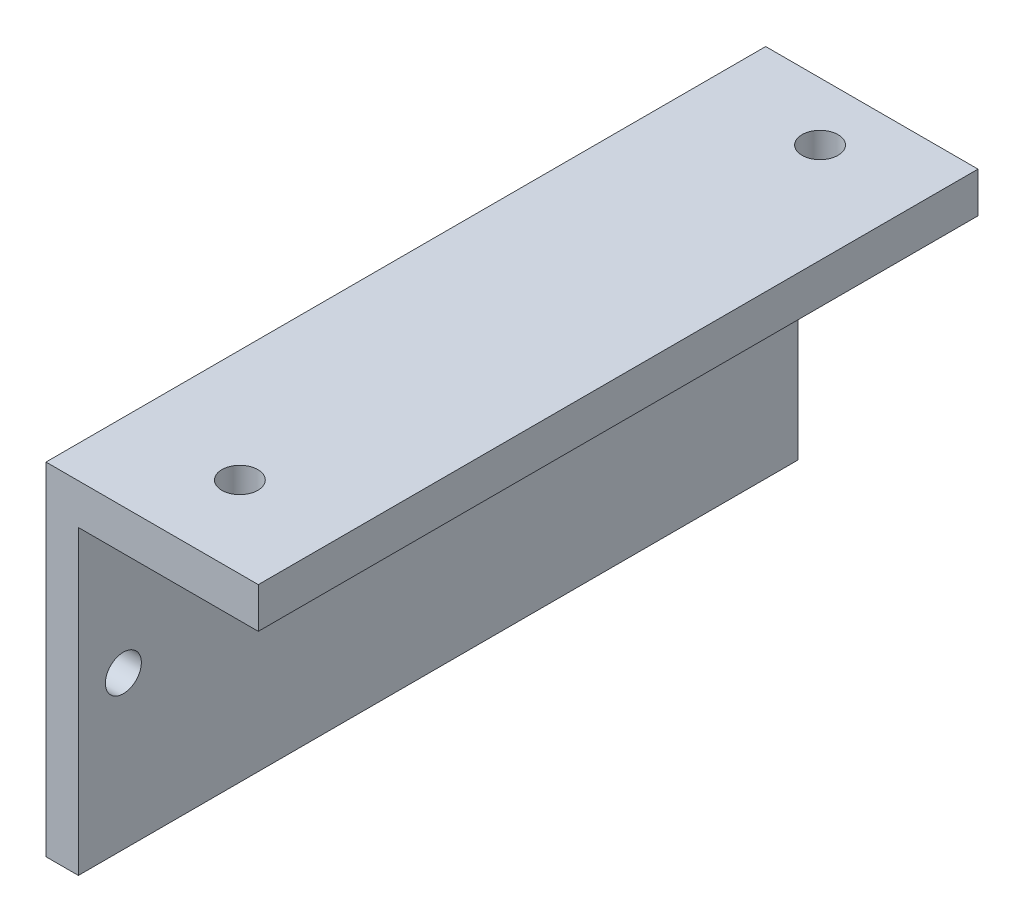
ISO-10303-21;
HEADER;
FILE_DESCRIPTION(('STEP AP214'),'2;1');
FILE_NAME('part.step','',(''),(''),'','','');
FILE_SCHEMA(('AUTOMOTIVE_DESIGN { 1 0 10303 214 1 1 1 1 }'));
ENDSEC;
DATA;
#1=APPLICATION_CONTEXT('core data for automotive mechanical design processes');
#2=APPLICATION_PROTOCOL_DEFINITION('international standard','automotive_design',2000,#1);
#3=PRODUCT_CONTEXT('',#1,'mechanical');
#4=PRODUCT('Part','Part','',(#3));
#5=PRODUCT_RELATED_PRODUCT_CATEGORY('part','',(#4));
#6=PRODUCT_DEFINITION_FORMATION('','',#4);
#7=PRODUCT_DEFINITION_CONTEXT('part definition',#1,'design');
#8=PRODUCT_DEFINITION('design','',#6,#7);
#9=PRODUCT_DEFINITION_SHAPE('','',#8);
#10=(LENGTH_UNIT() NAMED_UNIT(*) SI_UNIT(.MILLI.,.METRE.));
#11=(NAMED_UNIT(*) PLANE_ANGLE_UNIT() SI_UNIT($,.RADIAN.));
#12=(NAMED_UNIT(*) SI_UNIT($,.STERADIAN.) SOLID_ANGLE_UNIT());
#13=UNCERTAINTY_MEASURE_WITH_UNIT(LENGTH_MEASURE(1.E-05),#10,'distance_accuracy_value','');
#14=(GEOMETRIC_REPRESENTATION_CONTEXT(3) GLOBAL_UNCERTAINTY_ASSIGNED_CONTEXT((#13)) GLOBAL_UNIT_ASSIGNED_CONTEXT((#10,
#11,#12)) REPRESENTATION_CONTEXT('',''));
#15=CARTESIAN_POINT('',(0.,0.,0.));
#16=DIRECTION('',(0.,0.,1.));
#17=DIRECTION('',(1.,0.,0.));
#18=AXIS2_PLACEMENT_3D('',#15,#16,#17);
#19=CARTESIAN_POINT('',(23.6,0.,40.));
#20=DIRECTION('',(0.,0.,-1.));
#21=DIRECTION('',(-1.,0.,0.));
#22=AXIS2_PLACEMENT_3D('',#19,#20,#21);
#23=PLANE('',#22);
#24=DIRECTION('',(0.,-1.,0.));
#25=VECTOR('',#24,1.);
#26=CARTESIAN_POINT('',(0.,0.,40.));
#27=LINE('',#26,#25);
#28=CARTESIAN_POINT('',(0.,19.,40.));
#29=VERTEX_POINT('',#28);
#30=CARTESIAN_POINT('',(0.,-19.,40.));
#31=VERTEX_POINT('',#30);
#32=EDGE_CURVE('E192',#29,#31,#27,.T.);
#33=ORIENTED_EDGE('',*,*,#32,.T.);
#34=DIRECTION('',(-1.,0.,0.));
#35=VECTOR('',#34,1.);
#36=CARTESIAN_POINT('',(3.6,-19.,40.));
#37=LINE('',#36,#35);
#38=CARTESIAN_POINT('',(3.6,-19.,40.));
#39=VERTEX_POINT('',#38);
#40=EDGE_CURVE('E99',#39,#31,#37,.T.);
#41=ORIENTED_EDGE('',*,*,#40,.F.);
#42=DIRECTION('',(0.,-1.,0.));
#43=VECTOR('',#42,1.);
#44=CARTESIAN_POINT('',(3.6,0.,40.));
#45=LINE('',#44,#43);
#46=CARTESIAN_POINT('',(3.6,14.5,40.));
#47=VERTEX_POINT('',#46);
#48=EDGE_CURVE('E97',#47,#39,#45,.T.);
#49=ORIENTED_EDGE('',*,*,#48,.F.);
#50=DIRECTION('',(-1.,0.,0.));
#51=VECTOR('',#50,1.);
#52=CARTESIAN_POINT('',(23.6,14.5,40.));
#53=LINE('',#52,#51);
#54=CARTESIAN_POINT('',(23.6,14.5,40.));
#55=VERTEX_POINT('',#54);
#56=EDGE_CURVE('E11',#55,#47,#53,.T.);
#57=ORIENTED_EDGE('',*,*,#56,.F.);
#58=DIRECTION('',(0.,-1.,0.));
#59=VECTOR('',#58,1.);
#60=CARTESIAN_POINT('',(23.6,0.,40.));
#61=LINE('',#60,#59);
#62=CARTESIAN_POINT('',(23.6,19.,40.));
#63=VERTEX_POINT('',#62);
#64=EDGE_CURVE('E193',#63,#55,#61,.T.);
#65=ORIENTED_EDGE('',*,*,#64,.F.);
#66=DIRECTION('',(-1.,0.,0.));
#67=VECTOR('',#66,1.);
#68=CARTESIAN_POINT('',(23.6,19.,40.));
#69=LINE('',#68,#67);
#70=EDGE_CURVE('E60',#63,#29,#69,.T.);
#71=ORIENTED_EDGE('',*,*,#70,.T.);
#72=EDGE_LOOP('',(#33,#41,#49,#57,#65,#71));
#73=FACE_BOUND('',#72,.T.);
#74=ADVANCED_FACE('F37',(#73),#23,.F.);
#75=CARTESIAN_POINT('',(23.6,14.5,0.));
#76=DIRECTION('',(0.,1.,0.));
#77=DIRECTION('',(0.,0.,1.));
#78=AXIS2_PLACEMENT_3D('',#75,#76,#77);
#79=PLANE('',#78);
#80=CARTESIAN_POINT('',(12.5,14.5,30.9508755551064));
#81=DIRECTION('',(0.,1.,0.));
#82=DIRECTION('',(0.,0.,1.));
#83=AXIS2_PLACEMENT_3D('',#80,#81,#82);
#84=CIRCLE('',#83,2.);
#85=CARTESIAN_POINT('',(12.5,14.5,32.9508755551064));
#86=VERTEX_POINT('',#85);
#87=EDGE_CURVE('E162',#86,#86,#84,.F.);
#88=ORIENTED_EDGE('',*,*,#87,.F.);
#89=EDGE_LOOP('',(#88));
#90=FACE_BOUND('',#89,.T.);
#91=CARTESIAN_POINT('',(12.5,14.5,-33.5413181600046));
#92=DIRECTION('',(0.,1.,0.));
#93=DIRECTION('',(0.,0.,1.));
#94=AXIS2_PLACEMENT_3D('',#91,#92,#93);
#95=CIRCLE('',#94,2.);
#96=CARTESIAN_POINT('',(12.5,14.5,-31.5413181600046));
#97=VERTEX_POINT('',#96);
#98=EDGE_CURVE('E168',#97,#97,#95,.F.);
#99=ORIENTED_EDGE('',*,*,#98,.F.);
#100=EDGE_LOOP('',(#99));
#101=FACE_BOUND('',#100,.T.);
#102=ORIENTED_EDGE('',*,*,#56,.T.);
#103=DIRECTION('',(0.,0.,-1.));
#104=VECTOR('',#103,1.);
#105=CARTESIAN_POINT('',(3.6,14.5,0.));
#106=LINE('',#105,#104);
#107=CARTESIAN_POINT('',(3.6,14.5,-40.));
#108=VERTEX_POINT('',#107);
#109=EDGE_CURVE('E101',#47,#108,#106,.T.);
#110=ORIENTED_EDGE('',*,*,#109,.T.);
#111=DIRECTION('',(-1.,0.,0.));
#112=VECTOR('',#111,1.);
#113=CARTESIAN_POINT('',(23.6,14.5,-40.));
#114=LINE('',#113,#112);
#115=CARTESIAN_POINT('',(23.6,14.5,-40.));
#116=VERTEX_POINT('',#115);
#117=EDGE_CURVE('E44',#116,#108,#114,.T.);
#118=ORIENTED_EDGE('',*,*,#117,.F.);
#119=DIRECTION('',(0.,0.,-1.));
#120=VECTOR('',#119,1.);
#121=CARTESIAN_POINT('',(23.6,14.5,0.));
#122=LINE('',#121,#120);
#123=EDGE_CURVE('E80',#55,#116,#122,.T.);
#124=ORIENTED_EDGE('',*,*,#123,.F.);
#125=EDGE_LOOP('',(#102,#110,#118,#124));
#126=FACE_BOUND('',#125,.T.);
#127=ADVANCED_FACE('F108',(#90,#101,#126),#79,.F.);
#128=CARTESIAN_POINT('',(23.6,0.,-40.));
#129=DIRECTION('',(0.,0.,-1.));
#130=DIRECTION('',(-1.,0.,0.));
#131=AXIS2_PLACEMENT_3D('',#128,#129,#130);
#132=PLANE('',#131);
#133=DIRECTION('',(0.,-1.,0.));
#134=VECTOR('',#133,1.);
#135=CARTESIAN_POINT('',(0.,0.,-40.));
#136=LINE('',#135,#134);
#137=CARTESIAN_POINT('',(0.,19.,-40.));
#138=VERTEX_POINT('',#137);
#139=CARTESIAN_POINT('',(0.,-19.,-40.));
#140=VERTEX_POINT('',#139);
#141=EDGE_CURVE('E205',#138,#140,#136,.T.);
#142=ORIENTED_EDGE('',*,*,#141,.F.);
#143=DIRECTION('',(-1.,0.,0.));
#144=VECTOR('',#143,1.);
#145=CARTESIAN_POINT('',(23.6,19.,-40.));
#146=LINE('',#145,#144);
#147=CARTESIAN_POINT('',(23.6,19.,-40.));
#148=VERTEX_POINT('',#147);
#149=EDGE_CURVE('E211',#148,#138,#146,.T.);
#150=ORIENTED_EDGE('',*,*,#149,.F.);
#151=DIRECTION('',(0.,-1.,0.));
#152=VECTOR('',#151,1.);
#153=CARTESIAN_POINT('',(23.6,0.,-40.));
#154=LINE('',#153,#152);
#155=EDGE_CURVE('E198',#148,#116,#154,.T.);
#156=ORIENTED_EDGE('',*,*,#155,.T.);
#157=ORIENTED_EDGE('',*,*,#117,.T.);
#158=DIRECTION('',(0.,-1.,0.));
#159=VECTOR('',#158,1.);
#160=CARTESIAN_POINT('',(3.6,0.,-40.));
#161=LINE('',#160,#159);
#162=CARTESIAN_POINT('',(3.6,-19.,-40.));
#163=VERTEX_POINT('',#162);
#164=EDGE_CURVE('E51',#108,#163,#161,.T.);
#165=ORIENTED_EDGE('',*,*,#164,.T.);
#166=DIRECTION('',(-1.,0.,0.));
#167=VECTOR('',#166,1.);
#168=CARTESIAN_POINT('',(3.6,-19.,-40.));
#169=LINE('',#168,#167);
#170=EDGE_CURVE('E183',#163,#140,#169,.T.);
#171=ORIENTED_EDGE('',*,*,#170,.T.);
#172=EDGE_LOOP('',(#142,#150,#156,#157,#165,#171));
#173=FACE_BOUND('',#172,.T.);
#174=ADVANCED_FACE('F110',(#173),#132,.T.);
#175=CARTESIAN_POINT('',(23.6,19.,0.));
#176=DIRECTION('',(0.,1.,0.));
#177=DIRECTION('',(0.,0.,1.));
#178=AXIS2_PLACEMENT_3D('',#175,#176,#177);
#179=PLANE('',#178);
#180=CARTESIAN_POINT('',(12.5,19.,30.9508755551064));
#181=DIRECTION('',(0.,1.,0.));
#182=DIRECTION('',(0.,0.,1.));
#183=AXIS2_PLACEMENT_3D('',#180,#181,#182);
#184=CIRCLE('',#183,2.);
#185=CARTESIAN_POINT('',(12.5,19.,32.9508755551064));
#186=VERTEX_POINT('',#185);
#187=EDGE_CURVE('E160',#186,#186,#184,.T.);
#188=ORIENTED_EDGE('',*,*,#187,.F.);
#189=EDGE_LOOP('',(#188));
#190=FACE_BOUND('',#189,.T.);
#191=CARTESIAN_POINT('',(12.5,19.,-33.5413181600046));
#192=DIRECTION('',(0.,1.,0.));
#193=DIRECTION('',(0.,0.,1.));
#194=AXIS2_PLACEMENT_3D('',#191,#192,#193);
#195=CIRCLE('',#194,2.);
#196=CARTESIAN_POINT('',(12.5,19.,-31.5413181600046));
#197=VERTEX_POINT('',#196);
#198=EDGE_CURVE('E171',#197,#197,#195,.T.);
#199=ORIENTED_EDGE('',*,*,#198,.F.);
#200=EDGE_LOOP('',(#199));
#201=FACE_BOUND('',#200,.T.);
#202=DIRECTION('',(0.,0.,-1.));
#203=VECTOR('',#202,1.);
#204=CARTESIAN_POINT('',(0.,19.,0.));
#205=LINE('',#204,#203);
#206=EDGE_CURVE('E195',#29,#138,#205,.T.);
#207=ORIENTED_EDGE('',*,*,#206,.F.);
#208=ORIENTED_EDGE('',*,*,#70,.F.);
#209=DIRECTION('',(0.,0.,-1.));
#210=VECTOR('',#209,1.);
#211=CARTESIAN_POINT('',(23.6,19.,0.));
#212=LINE('',#211,#210);
#213=EDGE_CURVE('E201',#63,#148,#212,.T.);
#214=ORIENTED_EDGE('',*,*,#213,.T.);
#215=ORIENTED_EDGE('',*,*,#149,.T.);
#216=EDGE_LOOP('',(#207,#208,#214,#215));
#217=FACE_BOUND('',#216,.T.);
#218=ADVANCED_FACE('F116',(#190,#201,#217),#179,.T.);
#219=CARTESIAN_POINT('',(23.6,0.,0.));
#220=DIRECTION('',(1.,0.,0.));
#221=DIRECTION('',(0.,0.,-1.));
#222=AXIS2_PLACEMENT_3D('',#219,#220,#221);
#223=PLANE('',#222);
#224=ORIENTED_EDGE('',*,*,#64,.T.);
#225=ORIENTED_EDGE('',*,*,#123,.T.);
#226=ORIENTED_EDGE('',*,*,#155,.F.);
#227=ORIENTED_EDGE('',*,*,#213,.F.);
#228=EDGE_LOOP('',(#224,#225,#226,#227));
#229=FACE_BOUND('',#228,.T.);
#230=ADVANCED_FACE('F124',(#229),#223,.T.);
#231=CARTESIAN_POINT('',(0.,0.,0.));
#232=DIRECTION('',(1.,0.,0.));
#233=DIRECTION('',(0.,0.,-1.));
#234=AXIS2_PLACEMENT_3D('',#231,#232,#233);
#235=PLANE('',#234);
#236=ORIENTED_EDGE('',*,*,#32,.F.);
#237=ORIENTED_EDGE('',*,*,#206,.T.);
#238=ORIENTED_EDGE('',*,*,#141,.T.);
#239=DIRECTION('',(0.,0.,-1.));
#240=VECTOR('',#239,1.);
#241=CARTESIAN_POINT('',(0.,-19.,0.));
#242=LINE('',#241,#240);
#243=EDGE_CURVE('E179',#31,#140,#242,.T.);
#244=ORIENTED_EDGE('',*,*,#243,.F.);
#245=EDGE_LOOP('',(#236,#237,#238,#244));
#246=FACE_BOUND('',#245,.T.);
#247=CARTESIAN_POINT('',(0.,-2.,-35.));
#248=DIRECTION('',(1.,0.,0.));
#249=DIRECTION('',(0.,0.,-1.));
#250=AXIS2_PLACEMENT_3D('',#247,#248,#249);
#251=CIRCLE('',#250,2.);
#252=CARTESIAN_POINT('',(0.,-2.,-37.));
#253=VERTEX_POINT('',#252);
#254=EDGE_CURVE('E163',#253,#253,#251,.T.);
#255=ORIENTED_EDGE('',*,*,#254,.T.);
#256=EDGE_LOOP('',(#255));
#257=FACE_BOUND('',#256,.T.);
#258=CARTESIAN_POINT('',(0.,-2.,35.));
#259=DIRECTION('',(1.,0.,0.));
#260=DIRECTION('',(0.,0.,-1.));
#261=AXIS2_PLACEMENT_3D('',#258,#259,#260);
#262=CIRCLE('',#261,2.);
#263=CARTESIAN_POINT('',(0.,-2.,33.));
#264=VERTEX_POINT('',#263);
#265=EDGE_CURVE('E166',#264,#264,#262,.T.);
#266=ORIENTED_EDGE('',*,*,#265,.T.);
#267=EDGE_LOOP('',(#266));
#268=FACE_BOUND('',#267,.T.);
#269=ADVANCED_FACE('F126',(#246,#257,#268),#235,.F.);
#270=CARTESIAN_POINT('',(3.6,-19.,0.));
#271=DIRECTION('',(0.,1.,0.));
#272=DIRECTION('',(0.,0.,1.));
#273=AXIS2_PLACEMENT_3D('',#270,#271,#272);
#274=PLANE('',#273);
#275=ORIENTED_EDGE('',*,*,#243,.T.);
#276=ORIENTED_EDGE('',*,*,#170,.F.);
#277=DIRECTION('',(0.,0.,-1.));
#278=VECTOR('',#277,1.);
#279=CARTESIAN_POINT('',(3.6,-19.,0.));
#280=LINE('',#279,#278);
#281=EDGE_CURVE('E100',#39,#163,#280,.T.);
#282=ORIENTED_EDGE('',*,*,#281,.F.);
#283=ORIENTED_EDGE('',*,*,#40,.T.);
#284=EDGE_LOOP('',(#275,#276,#282,#283));
#285=FACE_BOUND('',#284,.T.);
#286=ADVANCED_FACE('F129',(#285),#274,.F.);
#287=CARTESIAN_POINT('',(3.6,-2.,35.));
#288=DIRECTION('',(-1.,0.,0.));
#289=DIRECTION('',(0.,0.,1.));
#290=AXIS2_PLACEMENT_3D('',#287,#288,#289);
#291=CYLINDRICAL_SURFACE('',#290,2.);
#292=CARTESIAN_POINT('',(3.6,-2.,35.));
#293=DIRECTION('',(1.,0.,0.));
#294=DIRECTION('',(0.,0.,-1.));
#295=AXIS2_PLACEMENT_3D('',#292,#293,#294);
#296=CIRCLE('',#295,2.);
#297=CARTESIAN_POINT('',(3.6,-2.,33.));
#298=VERTEX_POINT('',#297);
#299=EDGE_CURVE('E106',#298,#298,#296,.T.);
#300=ORIENTED_EDGE('',*,*,#299,.T.);
#301=EDGE_LOOP('',(#300));
#302=FACE_BOUND('',#301,.T.);
#303=ORIENTED_EDGE('',*,*,#265,.F.);
#304=EDGE_LOOP('',(#303));
#305=FACE_BOUND('',#304,.T.);
#306=ADVANCED_FACE('F137',(#302,#305),#291,.F.);
#307=CARTESIAN_POINT('',(3.6,-2.,-35.));
#308=DIRECTION('',(-1.,0.,0.));
#309=DIRECTION('',(0.,0.,1.));
#310=AXIS2_PLACEMENT_3D('',#307,#308,#309);
#311=CYLINDRICAL_SURFACE('',#310,2.);
#312=CARTESIAN_POINT('',(3.6,-2.,-35.));
#313=DIRECTION('',(1.,0.,0.));
#314=DIRECTION('',(0.,0.,-1.));
#315=AXIS2_PLACEMENT_3D('',#312,#313,#314);
#316=CIRCLE('',#315,2.);
#317=CARTESIAN_POINT('',(3.6,-2.,-37.));
#318=VERTEX_POINT('',#317);
#319=EDGE_CURVE('E176',#318,#318,#316,.T.);
#320=ORIENTED_EDGE('',*,*,#319,.T.);
#321=EDGE_LOOP('',(#320));
#322=FACE_BOUND('',#321,.T.);
#323=ORIENTED_EDGE('',*,*,#254,.F.);
#324=EDGE_LOOP('',(#323));
#325=FACE_BOUND('',#324,.T.);
#326=ADVANCED_FACE('F134',(#322,#325),#311,.F.);
#327=CARTESIAN_POINT('',(3.6,0.,0.));
#328=DIRECTION('',(1.,0.,0.));
#329=DIRECTION('',(0.,0.,-1.));
#330=AXIS2_PLACEMENT_3D('',#327,#328,#329);
#331=PLANE('',#330);
#332=ORIENTED_EDGE('',*,*,#319,.F.);
#333=EDGE_LOOP('',(#332));
#334=FACE_BOUND('',#333,.T.);
#335=ORIENTED_EDGE('',*,*,#299,.F.);
#336=EDGE_LOOP('',(#335));
#337=FACE_BOUND('',#336,.T.);
#338=ORIENTED_EDGE('',*,*,#109,.F.);
#339=ORIENTED_EDGE('',*,*,#48,.T.);
#340=ORIENTED_EDGE('',*,*,#281,.T.);
#341=ORIENTED_EDGE('',*,*,#164,.F.);
#342=EDGE_LOOP('',(#338,#339,#340,#341));
#343=FACE_BOUND('',#342,.T.);
#344=ADVANCED_FACE('F103',(#334,#337,#343),#331,.T.);
#345=CARTESIAN_POINT('',(12.5,-19.001,-33.5413181600046));
#346=DIRECTION('',(0.,1.,0.));
#347=DIRECTION('',(0.,0.,1.));
#348=AXIS2_PLACEMENT_3D('',#345,#346,#347);
#349=CYLINDRICAL_SURFACE('',#348,2.);
#350=ORIENTED_EDGE('',*,*,#198,.T.);
#351=EDGE_LOOP('',(#350));
#352=FACE_BOUND('',#351,.T.);
#353=ORIENTED_EDGE('',*,*,#98,.T.);
#354=EDGE_LOOP('',(#353));
#355=FACE_BOUND('',#354,.T.);
#356=ADVANCED_FACE('F147',(#352,#355),#349,.F.);
#357=CARTESIAN_POINT('',(12.5,-19.001,30.9508755551064));
#358=DIRECTION('',(0.,1.,0.));
#359=DIRECTION('',(0.,0.,1.));
#360=AXIS2_PLACEMENT_3D('',#357,#358,#359);
#361=CYLINDRICAL_SURFACE('',#360,2.);
#362=ORIENTED_EDGE('',*,*,#187,.T.);
#363=EDGE_LOOP('',(#362));
#364=FACE_BOUND('',#363,.T.);
#365=ORIENTED_EDGE('',*,*,#87,.T.);
#366=EDGE_LOOP('',(#365));
#367=FACE_BOUND('',#366,.T.);
#368=ADVANCED_FACE('F151',(#364,#367),#361,.F.);
#369=CLOSED_SHELL('',(#74,#127,#174,#218,#230,#269,#286,#306,#326,#344,#356,#368));
#370=MANIFOLD_SOLID_BREP('B2',#369);
#371=ADVANCED_BREP_SHAPE_REPRESENTATION('',(#18,#370),#14);
#372=SHAPE_DEFINITION_REPRESENTATION(#9,#371);
ENDSEC;
END-ISO-10303-21;
